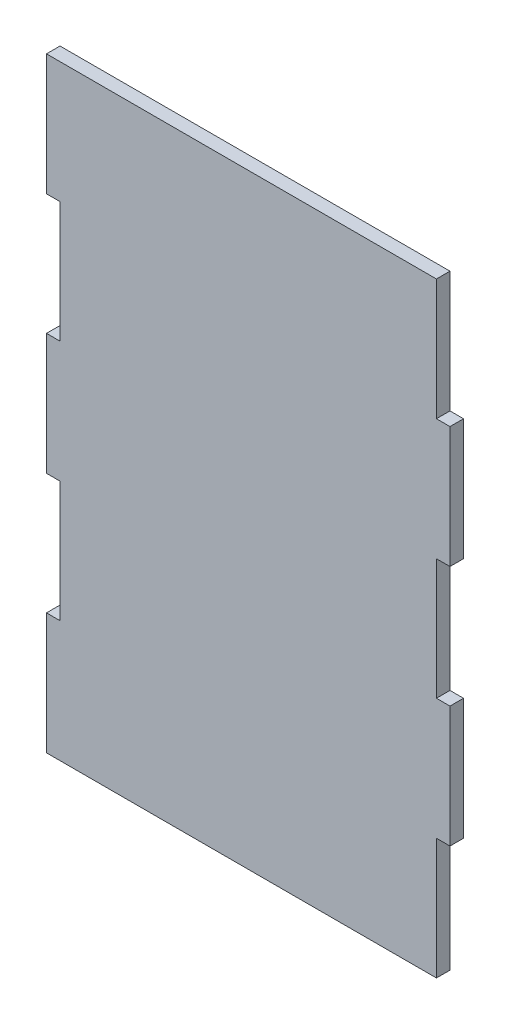
ISO-10303-21;
HEADER;
FILE_DESCRIPTION(('STEP AP214'),'2;1');
FILE_NAME('part.step','',(''),(''),'','','');
FILE_SCHEMA(('AUTOMOTIVE_DESIGN { 1 0 10303 214 1 1 1 1 }'));
ENDSEC;
DATA;
#1=APPLICATION_CONTEXT('core data for automotive mechanical design processes');
#2=APPLICATION_PROTOCOL_DEFINITION('international standard','automotive_design',2000,#1);
#3=PRODUCT_CONTEXT('',#1,'mechanical');
#4=PRODUCT('Part','Part','',(#3));
#5=PRODUCT_RELATED_PRODUCT_CATEGORY('part','',(#4));
#6=PRODUCT_DEFINITION_FORMATION('','',#4);
#7=PRODUCT_DEFINITION_CONTEXT('part definition',#1,'design');
#8=PRODUCT_DEFINITION('design','',#6,#7);
#9=PRODUCT_DEFINITION_SHAPE('','',#8);
#10=(LENGTH_UNIT() NAMED_UNIT(*) SI_UNIT(.MILLI.,.METRE.));
#11=(NAMED_UNIT(*) PLANE_ANGLE_UNIT() SI_UNIT($,.RADIAN.));
#12=(NAMED_UNIT(*) SI_UNIT($,.STERADIAN.) SOLID_ANGLE_UNIT());
#13=UNCERTAINTY_MEASURE_WITH_UNIT(LENGTH_MEASURE(1.E-05),#10,'distance_accuracy_value','');
#14=(GEOMETRIC_REPRESENTATION_CONTEXT(3) GLOBAL_UNCERTAINTY_ASSIGNED_CONTEXT((#13)) GLOBAL_UNIT_ASSIGNED_CONTEXT((#10,
#11,#12)) REPRESENTATION_CONTEXT('',''));
#15=CARTESIAN_POINT('',(0.,0.,0.));
#16=DIRECTION('',(0.,0.,1.));
#17=DIRECTION('',(1.,0.,0.));
#18=AXIS2_PLACEMENT_3D('',#15,#16,#17);
#19=CARTESIAN_POINT('',(-80.45314,-72.35686,-290.116912583318));
#20=DIRECTION('',(-1.,0.,0.));
#21=DIRECTION('',(0.,0.,1.));
#22=AXIS2_PLACEMENT_3D('',#19,#20,#21);
#23=PLANE('',#22);
#24=DIRECTION('',(0.,1.,0.));
#25=VECTOR('',#24,1.);
#26=CARTESIAN_POINT('',(-80.45314,-72.35686,0.));
#27=LINE('',#26,#25);
#28=CARTESIAN_POINT('',(-80.45314,-120.70314,0.));
#29=VERTEX_POINT('',#28);
#30=CARTESIAN_POINT('',(-80.45314,-72.35686,0.));
#31=VERTEX_POINT('',#30);
#32=EDGE_CURVE('E50',#29,#31,#27,.T.);
#33=ORIENTED_EDGE('',*,*,#32,.F.);
#34=DIRECTION('',(0.,0.,1.));
#35=VECTOR('',#34,1.);
#36=CARTESIAN_POINT('',(-80.45314,-120.70314,-290.116912583318));
#37=LINE('',#36,#35);
#38=CARTESIAN_POINT('',(-80.45314,-120.70314,5.4));
#39=VERTEX_POINT('',#38);
#40=EDGE_CURVE('E177',#29,#39,#37,.T.);
#41=ORIENTED_EDGE('',*,*,#40,.T.);
#42=DIRECTION('',(0.,-1.,0.));
#43=VECTOR('',#42,1.);
#44=CARTESIAN_POINT('',(-80.45314,-72.35686,5.4));
#45=LINE('',#44,#43);
#46=CARTESIAN_POINT('',(-80.45314,-72.35686,5.4));
#47=VERTEX_POINT('',#46);
#48=EDGE_CURVE('E181',#47,#39,#45,.T.);
#49=ORIENTED_EDGE('',*,*,#48,.F.);
#50=DIRECTION('',(0.,0.,1.));
#51=VECTOR('',#50,1.);
#52=CARTESIAN_POINT('',(-80.45314,-72.35686,-290.116912583318));
#53=LINE('',#52,#51);
#54=EDGE_CURVE('E273',#31,#47,#53,.T.);
#55=ORIENTED_EDGE('',*,*,#54,.F.);
#56=EDGE_LOOP('',(#33,#41,#49,#55));
#57=FACE_BOUND('',#56,.T.);
#58=ADVANCED_FACE('F41',(#57),#23,.T.);
#59=CARTESIAN_POINT('',(-75.05314,-72.35686,-290.116912583318));
#60=DIRECTION('',(0.,1.,0.));
#61=DIRECTION('',(0.,0.,1.));
#62=AXIS2_PLACEMENT_3D('',#59,#60,#61);
#63=PLANE('',#62);
#64=DIRECTION('',(1.,0.,0.));
#65=VECTOR('',#64,1.);
#66=CARTESIAN_POINT('',(-75.05314,-72.35686,0.));
#67=LINE('',#66,#65);
#68=CARTESIAN_POINT('',(-75.05314,-72.35686,0.));
#69=VERTEX_POINT('',#68);
#70=EDGE_CURVE('E377',#31,#69,#67,.T.);
#71=ORIENTED_EDGE('',*,*,#70,.F.);
#72=ORIENTED_EDGE('',*,*,#54,.T.);
#73=DIRECTION('',(-1.,0.,0.));
#74=VECTOR('',#73,1.);
#75=CARTESIAN_POINT('',(-75.05314,-72.35686,5.4));
#76=LINE('',#75,#74);
#77=CARTESIAN_POINT('',(-75.05314,-72.35686,5.4));
#78=VERTEX_POINT('',#77);
#79=EDGE_CURVE('E187',#78,#47,#76,.T.);
#80=ORIENTED_EDGE('',*,*,#79,.F.);
#81=DIRECTION('',(0.,0.,1.));
#82=VECTOR('',#81,1.);
#83=CARTESIAN_POINT('',(-75.05314,-72.35686,-290.116912583318));
#84=LINE('',#83,#82);
#85=EDGE_CURVE('E277',#69,#78,#84,.T.);
#86=ORIENTED_EDGE('',*,*,#85,.F.);
#87=EDGE_LOOP('',(#71,#72,#80,#86));
#88=FACE_BOUND('',#87,.T.);
#89=ADVANCED_FACE('F384',(#88),#63,.T.);
#90=CARTESIAN_POINT('',(-75.05314,-24.17314,-290.116912583318));
#91=DIRECTION('',(-1.,0.,0.));
#92=DIRECTION('',(0.,0.,1.));
#93=AXIS2_PLACEMENT_3D('',#90,#91,#92);
#94=PLANE('',#93);
#95=DIRECTION('',(0.,1.,0.));
#96=VECTOR('',#95,1.);
#97=CARTESIAN_POINT('',(-75.05314,-24.17314,0.));
#98=LINE('',#97,#96);
#99=CARTESIAN_POINT('',(-75.05314,-24.17314,0.));
#100=VERTEX_POINT('',#99);
#101=EDGE_CURVE('E374',#69,#100,#98,.T.);
#102=ORIENTED_EDGE('',*,*,#101,.F.);
#103=ORIENTED_EDGE('',*,*,#85,.T.);
#104=DIRECTION('',(0.,-1.,0.));
#105=VECTOR('',#104,1.);
#106=CARTESIAN_POINT('',(-75.05314,-24.17314,5.4));
#107=LINE('',#106,#105);
#108=CARTESIAN_POINT('',(-75.05314,-24.17314,5.4));
#109=VERTEX_POINT('',#108);
#110=EDGE_CURVE('E268',#109,#78,#107,.T.);
#111=ORIENTED_EDGE('',*,*,#110,.F.);
#112=DIRECTION('',(0.,0.,1.));
#113=VECTOR('',#112,1.);
#114=CARTESIAN_POINT('',(-75.05314,-24.17314,-290.116912583318));
#115=LINE('',#114,#113);
#116=EDGE_CURVE('E280',#100,#109,#115,.T.);
#117=ORIENTED_EDGE('',*,*,#116,.F.);
#118=EDGE_LOOP('',(#102,#103,#111,#117));
#119=FACE_BOUND('',#118,.T.);
#120=ADVANCED_FACE('F387',(#119),#94,.T.);
#121=CARTESIAN_POINT('',(-80.45314,-24.17314,-290.116912583318));
#122=DIRECTION('',(0.,-1.,0.));
#123=DIRECTION('',(1.,0.,0.));
#124=AXIS2_PLACEMENT_3D('',#121,#122,#123);
#125=PLANE('',#124);
#126=DIRECTION('',(-1.,0.,0.));
#127=VECTOR('',#126,1.);
#128=CARTESIAN_POINT('',(-80.45314,-24.17314,0.));
#129=LINE('',#128,#127);
#130=CARTESIAN_POINT('',(-80.45314,-24.17314,0.));
#131=VERTEX_POINT('',#130);
#132=EDGE_CURVE('E371',#100,#131,#129,.T.);
#133=ORIENTED_EDGE('',*,*,#132,.F.);
#134=ORIENTED_EDGE('',*,*,#116,.T.);
#135=DIRECTION('',(1.,0.,0.));
#136=VECTOR('',#135,1.);
#137=CARTESIAN_POINT('',(-80.45314,-24.17314,5.4));
#138=LINE('',#137,#136);
#139=CARTESIAN_POINT('',(-80.45314,-24.17314,5.4));
#140=VERTEX_POINT('',#139);
#141=EDGE_CURVE('E264',#140,#109,#138,.T.);
#142=ORIENTED_EDGE('',*,*,#141,.F.);
#143=DIRECTION('',(0.,0.,1.));
#144=VECTOR('',#143,1.);
#145=CARTESIAN_POINT('',(-80.45314,-24.17314,-290.116912583318));
#146=LINE('',#145,#144);
#147=EDGE_CURVE('E283',#131,#140,#146,.T.);
#148=ORIENTED_EDGE('',*,*,#147,.F.);
#149=EDGE_LOOP('',(#133,#134,#142,#148));
#150=FACE_BOUND('',#149,.T.);
#151=ADVANCED_FACE('F394',(#150),#125,.T.);
#152=CARTESIAN_POINT('',(-80.45314,24.17314,-290.116912583318));
#153=DIRECTION('',(-1.,0.,0.));
#154=DIRECTION('',(0.,0.,1.));
#155=AXIS2_PLACEMENT_3D('',#152,#153,#154);
#156=PLANE('',#155);
#157=DIRECTION('',(0.,1.,0.));
#158=VECTOR('',#157,1.);
#159=CARTESIAN_POINT('',(-80.45314,24.17314,0.));
#160=LINE('',#159,#158);
#161=CARTESIAN_POINT('',(-80.45314,24.17314,0.));
#162=VERTEX_POINT('',#161);
#163=EDGE_CURVE('E368',#131,#162,#160,.T.);
#164=ORIENTED_EDGE('',*,*,#163,.F.);
#165=ORIENTED_EDGE('',*,*,#147,.T.);
#166=DIRECTION('',(0.,-1.,0.));
#167=VECTOR('',#166,1.);
#168=CARTESIAN_POINT('',(-80.45314,24.17314,5.4));
#169=LINE('',#168,#167);
#170=CARTESIAN_POINT('',(-80.45314,24.17314,5.4));
#171=VERTEX_POINT('',#170);
#172=EDGE_CURVE('E260',#171,#140,#169,.T.);
#173=ORIENTED_EDGE('',*,*,#172,.F.);
#174=DIRECTION('',(0.,0.,1.));
#175=VECTOR('',#174,1.);
#176=CARTESIAN_POINT('',(-80.45314,24.17314,-290.116912583318));
#177=LINE('',#176,#175);
#178=EDGE_CURVE('E286',#162,#171,#177,.T.);
#179=ORIENTED_EDGE('',*,*,#178,.F.);
#180=EDGE_LOOP('',(#164,#165,#173,#179));
#181=FACE_BOUND('',#180,.T.);
#182=ADVANCED_FACE('F399',(#181),#156,.T.);
#183=CARTESIAN_POINT('',(-75.05314,24.17314,-290.116912583318));
#184=DIRECTION('',(0.,1.,0.));
#185=DIRECTION('',(-1.,0.,0.));
#186=AXIS2_PLACEMENT_3D('',#183,#184,#185);
#187=PLANE('',#186);
#188=DIRECTION('',(1.,0.,0.));
#189=VECTOR('',#188,1.);
#190=CARTESIAN_POINT('',(-75.05314,24.17314,0.));
#191=LINE('',#190,#189);
#192=CARTESIAN_POINT('',(-75.05314,24.17314,0.));
#193=VERTEX_POINT('',#192);
#194=EDGE_CURVE('E365',#162,#193,#191,.T.);
#195=ORIENTED_EDGE('',*,*,#194,.F.);
#196=ORIENTED_EDGE('',*,*,#178,.T.);
#197=DIRECTION('',(-1.,0.,0.));
#198=VECTOR('',#197,1.);
#199=CARTESIAN_POINT('',(-75.05314,24.17314,5.4));
#200=LINE('',#199,#198);
#201=CARTESIAN_POINT('',(-75.05314,24.17314,5.4));
#202=VERTEX_POINT('',#201);
#203=EDGE_CURVE('E256',#202,#171,#200,.T.);
#204=ORIENTED_EDGE('',*,*,#203,.F.);
#205=DIRECTION('',(0.,0.,1.));
#206=VECTOR('',#205,1.);
#207=CARTESIAN_POINT('',(-75.05314,24.17314,-290.116912583318));
#208=LINE('',#207,#206);
#209=EDGE_CURVE('E289',#193,#202,#208,.T.);
#210=ORIENTED_EDGE('',*,*,#209,.F.);
#211=EDGE_LOOP('',(#195,#196,#204,#210));
#212=FACE_BOUND('',#211,.T.);
#213=ADVANCED_FACE('F402',(#212),#187,.T.);
#214=CARTESIAN_POINT('',(-75.05314,72.35686,-290.116912583318));
#215=DIRECTION('',(-1.,0.,0.));
#216=DIRECTION('',(0.,0.,1.));
#217=AXIS2_PLACEMENT_3D('',#214,#215,#216);
#218=PLANE('',#217);
#219=DIRECTION('',(0.,1.,0.));
#220=VECTOR('',#219,1.);
#221=CARTESIAN_POINT('',(-75.05314,72.35686,0.));
#222=LINE('',#221,#220);
#223=CARTESIAN_POINT('',(-75.05314,72.35686,0.));
#224=VERTEX_POINT('',#223);
#225=EDGE_CURVE('E362',#193,#224,#222,.T.);
#226=ORIENTED_EDGE('',*,*,#225,.F.);
#227=ORIENTED_EDGE('',*,*,#209,.T.);
#228=DIRECTION('',(0.,-1.,0.));
#229=VECTOR('',#228,1.);
#230=CARTESIAN_POINT('',(-75.05314,72.35686,5.4));
#231=LINE('',#230,#229);
#232=CARTESIAN_POINT('',(-75.05314,72.35686,5.4));
#233=VERTEX_POINT('',#232);
#234=EDGE_CURVE('E252',#233,#202,#231,.T.);
#235=ORIENTED_EDGE('',*,*,#234,.F.);
#236=DIRECTION('',(0.,0.,1.));
#237=VECTOR('',#236,1.);
#238=CARTESIAN_POINT('',(-75.05314,72.35686,-290.116912583318));
#239=LINE('',#238,#237);
#240=EDGE_CURVE('E292',#224,#233,#239,.T.);
#241=ORIENTED_EDGE('',*,*,#240,.F.);
#242=EDGE_LOOP('',(#226,#227,#235,#241));
#243=FACE_BOUND('',#242,.T.);
#244=ADVANCED_FACE('F408',(#243),#218,.T.);
#245=CARTESIAN_POINT('',(-80.45314,72.35686,-290.116912583318));
#246=DIRECTION('',(0.,-1.,0.));
#247=DIRECTION('',(0.,0.,-1.));
#248=AXIS2_PLACEMENT_3D('',#245,#246,#247);
#249=PLANE('',#248);
#250=DIRECTION('',(-1.,0.,0.));
#251=VECTOR('',#250,1.);
#252=CARTESIAN_POINT('',(-80.45314,72.35686,0.));
#253=LINE('',#252,#251);
#254=CARTESIAN_POINT('',(-80.45314,72.35686,0.));
#255=VERTEX_POINT('',#254);
#256=EDGE_CURVE('E359',#224,#255,#253,.T.);
#257=ORIENTED_EDGE('',*,*,#256,.F.);
#258=ORIENTED_EDGE('',*,*,#240,.T.);
#259=DIRECTION('',(1.,0.,0.));
#260=VECTOR('',#259,1.);
#261=CARTESIAN_POINT('',(-80.45314,72.35686,5.4));
#262=LINE('',#261,#260);
#263=CARTESIAN_POINT('',(-80.45314,72.35686,5.4));
#264=VERTEX_POINT('',#263);
#265=EDGE_CURVE('E248',#264,#233,#262,.T.);
#266=ORIENTED_EDGE('',*,*,#265,.F.);
#267=DIRECTION('',(0.,0.,1.));
#268=VECTOR('',#267,1.);
#269=CARTESIAN_POINT('',(-80.45314,72.35686,-290.116912583318));
#270=LINE('',#269,#268);
#271=EDGE_CURVE('E295',#255,#264,#270,.T.);
#272=ORIENTED_EDGE('',*,*,#271,.F.);
#273=EDGE_LOOP('',(#257,#258,#266,#272));
#274=FACE_BOUND('',#273,.T.);
#275=ADVANCED_FACE('F412',(#274),#249,.T.);
#276=CARTESIAN_POINT('',(-80.45314,120.70314,-290.116912583318));
#277=DIRECTION('',(-1.,0.,0.));
#278=DIRECTION('',(0.,0.,1.));
#279=AXIS2_PLACEMENT_3D('',#276,#277,#278);
#280=PLANE('',#279);
#281=DIRECTION('',(0.,1.,0.));
#282=VECTOR('',#281,1.);
#283=CARTESIAN_POINT('',(-80.45314,120.70314,0.));
#284=LINE('',#283,#282);
#285=CARTESIAN_POINT('',(-80.45314,120.70314,0.));
#286=VERTEX_POINT('',#285);
#287=EDGE_CURVE('E356',#255,#286,#284,.T.);
#288=ORIENTED_EDGE('',*,*,#287,.F.);
#289=ORIENTED_EDGE('',*,*,#271,.T.);
#290=DIRECTION('',(0.,-1.,0.));
#291=VECTOR('',#290,1.);
#292=CARTESIAN_POINT('',(-80.45314,120.70314,5.4));
#293=LINE('',#292,#291);
#294=CARTESIAN_POINT('',(-80.45314,120.70314,5.4));
#295=VERTEX_POINT('',#294);
#296=EDGE_CURVE('E244',#295,#264,#293,.T.);
#297=ORIENTED_EDGE('',*,*,#296,.F.);
#298=DIRECTION('',(0.,0.,1.));
#299=VECTOR('',#298,1.);
#300=CARTESIAN_POINT('',(-80.45314,120.70314,-290.116912583318));
#301=LINE('',#300,#299);
#302=EDGE_CURVE('E298',#286,#295,#301,.T.);
#303=ORIENTED_EDGE('',*,*,#302,.F.);
#304=EDGE_LOOP('',(#288,#289,#297,#303));
#305=FACE_BOUND('',#304,.T.);
#306=ADVANCED_FACE('F418',(#305),#280,.T.);
#307=CARTESIAN_POINT('',(75.05314,120.70314,-290.116912583318));
#308=DIRECTION('',(0.,1.,0.));
#309=DIRECTION('',(-1.,0.,0.));
#310=AXIS2_PLACEMENT_3D('',#307,#308,#309);
#311=PLANE('',#310);
#312=DIRECTION('',(1.,0.,0.));
#313=VECTOR('',#312,1.);
#314=CARTESIAN_POINT('',(75.05314,120.70314,0.));
#315=LINE('',#314,#313);
#316=CARTESIAN_POINT('',(75.05314,120.70314,0.));
#317=VERTEX_POINT('',#316);
#318=EDGE_CURVE('E353',#286,#317,#315,.T.);
#319=ORIENTED_EDGE('',*,*,#318,.F.);
#320=ORIENTED_EDGE('',*,*,#302,.T.);
#321=DIRECTION('',(-1.,0.,0.));
#322=VECTOR('',#321,1.);
#323=CARTESIAN_POINT('',(75.05314,120.70314,5.4));
#324=LINE('',#323,#322);
#325=CARTESIAN_POINT('',(75.05314,120.70314,5.4));
#326=VERTEX_POINT('',#325);
#327=EDGE_CURVE('E240',#326,#295,#324,.T.);
#328=ORIENTED_EDGE('',*,*,#327,.F.);
#329=DIRECTION('',(0.,0.,1.));
#330=VECTOR('',#329,1.);
#331=CARTESIAN_POINT('',(75.05314,120.70314,-290.116912583318));
#332=LINE('',#331,#330);
#333=EDGE_CURVE('E301',#317,#326,#332,.T.);
#334=ORIENTED_EDGE('',*,*,#333,.F.);
#335=EDGE_LOOP('',(#319,#320,#328,#334));
#336=FACE_BOUND('',#335,.T.);
#337=ADVANCED_FACE('F422',(#336),#311,.T.);
#338=CARTESIAN_POINT('',(75.05314,72.43814,-290.116912583318));
#339=DIRECTION('',(1.,0.,0.));
#340=DIRECTION('',(0.,0.,-1.));
#341=AXIS2_PLACEMENT_3D('',#338,#339,#340);
#342=PLANE('',#341);
#343=DIRECTION('',(0.,-1.,0.));
#344=VECTOR('',#343,1.);
#345=CARTESIAN_POINT('',(75.05314,72.43814,0.));
#346=LINE('',#345,#344);
#347=CARTESIAN_POINT('',(75.05314,72.43814,0.));
#348=VERTEX_POINT('',#347);
#349=EDGE_CURVE('E350',#317,#348,#346,.T.);
#350=ORIENTED_EDGE('',*,*,#349,.F.);
#351=ORIENTED_EDGE('',*,*,#333,.T.);
#352=DIRECTION('',(0.,1.,0.));
#353=VECTOR('',#352,1.);
#354=CARTESIAN_POINT('',(75.05314,72.43814,5.4));
#355=LINE('',#354,#353);
#356=CARTESIAN_POINT('',(75.05314,72.43814,5.4));
#357=VERTEX_POINT('',#356);
#358=EDGE_CURVE('E236',#357,#326,#355,.T.);
#359=ORIENTED_EDGE('',*,*,#358,.F.);
#360=DIRECTION('',(0.,0.,1.));
#361=VECTOR('',#360,1.);
#362=CARTESIAN_POINT('',(75.05314,72.43814,-290.116912583318));
#363=LINE('',#362,#361);
#364=EDGE_CURVE('E304',#348,#357,#363,.T.);
#365=ORIENTED_EDGE('',*,*,#364,.F.);
#366=EDGE_LOOP('',(#350,#351,#359,#365));
#367=FACE_BOUND('',#366,.T.);
#368=ADVANCED_FACE('F428',(#367),#342,.T.);
#369=CARTESIAN_POINT('',(80.45314,72.43814,-290.116912583318));
#370=DIRECTION('',(0.,1.,0.));
#371=DIRECTION('',(0.,0.,1.));
#372=AXIS2_PLACEMENT_3D('',#369,#370,#371);
#373=PLANE('',#372);
#374=DIRECTION('',(1.,0.,0.));
#375=VECTOR('',#374,1.);
#376=CARTESIAN_POINT('',(80.45314,72.43814,0.));
#377=LINE('',#376,#375);
#378=CARTESIAN_POINT('',(80.45314,72.43814,0.));
#379=VERTEX_POINT('',#378);
#380=EDGE_CURVE('E347',#348,#379,#377,.T.);
#381=ORIENTED_EDGE('',*,*,#380,.F.);
#382=ORIENTED_EDGE('',*,*,#364,.T.);
#383=DIRECTION('',(-1.,0.,0.));
#384=VECTOR('',#383,1.);
#385=CARTESIAN_POINT('',(80.45314,72.43814,5.4));
#386=LINE('',#385,#384);
#387=CARTESIAN_POINT('',(80.45314,72.43814,5.4));
#388=VERTEX_POINT('',#387);
#389=EDGE_CURVE('E232',#388,#357,#386,.T.);
#390=ORIENTED_EDGE('',*,*,#389,.F.);
#391=DIRECTION('',(0.,0.,1.));
#392=VECTOR('',#391,1.);
#393=CARTESIAN_POINT('',(80.45314,72.43814,-290.116912583318));
#394=LINE('',#393,#392);
#395=EDGE_CURVE('E307',#379,#388,#394,.T.);
#396=ORIENTED_EDGE('',*,*,#395,.F.);
#397=EDGE_LOOP('',(#381,#382,#390,#396));
#398=FACE_BOUND('',#397,.T.);
#399=ADVANCED_FACE('F432',(#398),#373,.T.);
#400=CARTESIAN_POINT('',(80.45314,24.09186,-290.116912583318));
#401=DIRECTION('',(1.,0.,0.));
#402=DIRECTION('',(0.,0.,-1.));
#403=AXIS2_PLACEMENT_3D('',#400,#401,#402);
#404=PLANE('',#403);
#405=DIRECTION('',(0.,-1.,0.));
#406=VECTOR('',#405,1.);
#407=CARTESIAN_POINT('',(80.45314,24.09186,0.));
#408=LINE('',#407,#406);
#409=CARTESIAN_POINT('',(80.45314,24.09186,0.));
#410=VERTEX_POINT('',#409);
#411=EDGE_CURVE('E344',#379,#410,#408,.T.);
#412=ORIENTED_EDGE('',*,*,#411,.F.);
#413=ORIENTED_EDGE('',*,*,#395,.T.);
#414=DIRECTION('',(0.,1.,0.));
#415=VECTOR('',#414,1.);
#416=CARTESIAN_POINT('',(80.45314,24.09186,5.4));
#417=LINE('',#416,#415);
#418=CARTESIAN_POINT('',(80.45314,24.09186,5.4));
#419=VERTEX_POINT('',#418);
#420=EDGE_CURVE('E228',#419,#388,#417,.T.);
#421=ORIENTED_EDGE('',*,*,#420,.F.);
#422=DIRECTION('',(0.,0.,1.));
#423=VECTOR('',#422,1.);
#424=CARTESIAN_POINT('',(80.45314,24.09186,-290.116912583318));
#425=LINE('',#424,#423);
#426=EDGE_CURVE('E310',#410,#419,#425,.T.);
#427=ORIENTED_EDGE('',*,*,#426,.F.);
#428=EDGE_LOOP('',(#412,#413,#421,#427));
#429=FACE_BOUND('',#428,.T.);
#430=ADVANCED_FACE('F438',(#429),#404,.T.);
#431=CARTESIAN_POINT('',(75.05314,24.09186,-290.116912583318));
#432=DIRECTION('',(0.,-1.,0.));
#433=DIRECTION('',(0.,0.,-1.));
#434=AXIS2_PLACEMENT_3D('',#431,#432,#433);
#435=PLANE('',#434);
#436=DIRECTION('',(-1.,0.,0.));
#437=VECTOR('',#436,1.);
#438=CARTESIAN_POINT('',(75.05314,24.09186,0.));
#439=LINE('',#438,#437);
#440=CARTESIAN_POINT('',(75.05314,24.09186,0.));
#441=VERTEX_POINT('',#440);
#442=EDGE_CURVE('E341',#410,#441,#439,.T.);
#443=ORIENTED_EDGE('',*,*,#442,.F.);
#444=ORIENTED_EDGE('',*,*,#426,.T.);
#445=DIRECTION('',(1.,0.,0.));
#446=VECTOR('',#445,1.);
#447=CARTESIAN_POINT('',(75.05314,24.09186,5.4));
#448=LINE('',#447,#446);
#449=CARTESIAN_POINT('',(75.05314,24.09186,5.4));
#450=VERTEX_POINT('',#449);
#451=EDGE_CURVE('E224',#450,#419,#448,.T.);
#452=ORIENTED_EDGE('',*,*,#451,.F.);
#453=DIRECTION('',(0.,0.,1.));
#454=VECTOR('',#453,1.);
#455=CARTESIAN_POINT('',(75.05314,24.09186,-290.116912583318));
#456=LINE('',#455,#454);
#457=EDGE_CURVE('E313',#441,#450,#456,.T.);
#458=ORIENTED_EDGE('',*,*,#457,.F.);
#459=EDGE_LOOP('',(#443,#444,#452,#458));
#460=FACE_BOUND('',#459,.T.);
#461=ADVANCED_FACE('F442',(#460),#435,.T.);
#462=CARTESIAN_POINT('',(75.05314,-24.09186,-290.116912583318));
#463=DIRECTION('',(1.,0.,0.));
#464=DIRECTION('',(0.,0.,-1.));
#465=AXIS2_PLACEMENT_3D('',#462,#463,#464);
#466=PLANE('',#465);
#467=DIRECTION('',(0.,-1.,0.));
#468=VECTOR('',#467,1.);
#469=CARTESIAN_POINT('',(75.05314,-24.09186,0.));
#470=LINE('',#469,#468);
#471=CARTESIAN_POINT('',(75.05314,-24.09186,0.));
#472=VERTEX_POINT('',#471);
#473=EDGE_CURVE('E338',#441,#472,#470,.T.);
#474=ORIENTED_EDGE('',*,*,#473,.F.);
#475=ORIENTED_EDGE('',*,*,#457,.T.);
#476=DIRECTION('',(0.,1.,0.));
#477=VECTOR('',#476,1.);
#478=CARTESIAN_POINT('',(75.05314,-24.09186,5.4));
#479=LINE('',#478,#477);
#480=CARTESIAN_POINT('',(75.05314,-24.09186,5.4));
#481=VERTEX_POINT('',#480);
#482=EDGE_CURVE('E220',#481,#450,#479,.T.);
#483=ORIENTED_EDGE('',*,*,#482,.F.);
#484=DIRECTION('',(0.,0.,1.));
#485=VECTOR('',#484,1.);
#486=CARTESIAN_POINT('',(75.05314,-24.09186,-290.116912583318));
#487=LINE('',#486,#485);
#488=EDGE_CURVE('E316',#472,#481,#487,.T.);
#489=ORIENTED_EDGE('',*,*,#488,.F.);
#490=EDGE_LOOP('',(#474,#475,#483,#489));
#491=FACE_BOUND('',#490,.T.);
#492=ADVANCED_FACE('F448',(#491),#466,.T.);
#493=CARTESIAN_POINT('',(80.45314,-24.09186,-290.116912583318));
#494=DIRECTION('',(0.,1.,0.));
#495=DIRECTION('',(0.,0.,1.));
#496=AXIS2_PLACEMENT_3D('',#493,#494,#495);
#497=PLANE('',#496);
#498=DIRECTION('',(1.,0.,0.));
#499=VECTOR('',#498,1.);
#500=CARTESIAN_POINT('',(80.45314,-24.09186,0.));
#501=LINE('',#500,#499);
#502=CARTESIAN_POINT('',(80.45314,-24.09186,0.));
#503=VERTEX_POINT('',#502);
#504=EDGE_CURVE('E335',#472,#503,#501,.T.);
#505=ORIENTED_EDGE('',*,*,#504,.F.);
#506=ORIENTED_EDGE('',*,*,#488,.T.);
#507=DIRECTION('',(-1.,0.,0.));
#508=VECTOR('',#507,1.);
#509=CARTESIAN_POINT('',(80.45314,-24.09186,5.4));
#510=LINE('',#509,#508);
#511=CARTESIAN_POINT('',(80.45314,-24.09186,5.4));
#512=VERTEX_POINT('',#511);
#513=EDGE_CURVE('E216',#512,#481,#510,.T.);
#514=ORIENTED_EDGE('',*,*,#513,.F.);
#515=DIRECTION('',(0.,0.,1.));
#516=VECTOR('',#515,1.);
#517=CARTESIAN_POINT('',(80.45314,-24.09186,-290.116912583318));
#518=LINE('',#517,#516);
#519=EDGE_CURVE('E319',#503,#512,#518,.T.);
#520=ORIENTED_EDGE('',*,*,#519,.F.);
#521=EDGE_LOOP('',(#505,#506,#514,#520));
#522=FACE_BOUND('',#521,.T.);
#523=ADVANCED_FACE('F452',(#522),#497,.T.);
#524=CARTESIAN_POINT('',(80.45314,-72.43814,-290.116912583318));
#525=DIRECTION('',(1.,0.,0.));
#526=DIRECTION('',(0.,0.,-1.));
#527=AXIS2_PLACEMENT_3D('',#524,#525,#526);
#528=PLANE('',#527);
#529=DIRECTION('',(0.,-1.,0.));
#530=VECTOR('',#529,1.);
#531=CARTESIAN_POINT('',(80.45314,-72.43814,0.));
#532=LINE('',#531,#530);
#533=CARTESIAN_POINT('',(80.45314,-72.43814,0.));
#534=VERTEX_POINT('',#533);
#535=EDGE_CURVE('E62',#503,#534,#532,.T.);
#536=ORIENTED_EDGE('',*,*,#535,.F.);
#537=ORIENTED_EDGE('',*,*,#519,.T.);
#538=DIRECTION('',(0.,1.,0.));
#539=VECTOR('',#538,1.);
#540=CARTESIAN_POINT('',(80.45314,-72.43814,5.4));
#541=LINE('',#540,#539);
#542=CARTESIAN_POINT('',(80.45314,-72.43814,5.4));
#543=VERTEX_POINT('',#542);
#544=EDGE_CURVE('E212',#543,#512,#541,.T.);
#545=ORIENTED_EDGE('',*,*,#544,.F.);
#546=DIRECTION('',(0.,0.,1.));
#547=VECTOR('',#546,1.);
#548=CARTESIAN_POINT('',(80.45314,-72.43814,-290.116912583318));
#549=LINE('',#548,#547);
#550=EDGE_CURVE('E322',#534,#543,#549,.T.);
#551=ORIENTED_EDGE('',*,*,#550,.F.);
#552=EDGE_LOOP('',(#536,#537,#545,#551));
#553=FACE_BOUND('',#552,.T.);
#554=ADVANCED_FACE('F456',(#553),#528,.T.);
#555=CARTESIAN_POINT('',(75.05314,-72.43814,-290.116912583318));
#556=DIRECTION('',(0.,-1.,0.));
#557=DIRECTION('',(0.,0.,-1.));
#558=AXIS2_PLACEMENT_3D('',#555,#556,#557);
#559=PLANE('',#558);
#560=DIRECTION('',(-1.,0.,0.));
#561=VECTOR('',#560,1.);
#562=CARTESIAN_POINT('',(75.05314,-72.43814,0.));
#563=LINE('',#562,#561);
#564=CARTESIAN_POINT('',(75.05314,-72.43814,0.));
#565=VERTEX_POINT('',#564);
#566=EDGE_CURVE('E57',#534,#565,#563,.T.);
#567=ORIENTED_EDGE('',*,*,#566,.F.);
#568=ORIENTED_EDGE('',*,*,#550,.T.);
#569=DIRECTION('',(1.,0.,0.));
#570=VECTOR('',#569,1.);
#571=CARTESIAN_POINT('',(75.05314,-72.43814,5.4));
#572=LINE('',#571,#570);
#573=CARTESIAN_POINT('',(75.05314,-72.43814,5.4));
#574=VERTEX_POINT('',#573);
#575=EDGE_CURVE('E208',#574,#543,#572,.T.);
#576=ORIENTED_EDGE('',*,*,#575,.F.);
#577=DIRECTION('',(0.,0.,1.));
#578=VECTOR('',#577,1.);
#579=CARTESIAN_POINT('',(75.05314,-72.43814,-290.116912583318));
#580=LINE('',#579,#578);
#581=EDGE_CURVE('E325',#565,#574,#580,.T.);
#582=ORIENTED_EDGE('',*,*,#581,.F.);
#583=EDGE_LOOP('',(#567,#568,#576,#582));
#584=FACE_BOUND('',#583,.T.);
#585=ADVANCED_FACE('F460',(#584),#559,.T.);
#586=CARTESIAN_POINT('',(75.05314,-120.70314,-290.116912583318));
#587=DIRECTION('',(1.,0.,0.));
#588=DIRECTION('',(0.,0.,-1.));
#589=AXIS2_PLACEMENT_3D('',#586,#587,#588);
#590=PLANE('',#589);
#591=DIRECTION('',(0.,-1.,0.));
#592=VECTOR('',#591,1.);
#593=CARTESIAN_POINT('',(75.05314,-120.70314,0.));
#594=LINE('',#593,#592);
#595=CARTESIAN_POINT('',(75.05314,-120.70314,0.));
#596=VERTEX_POINT('',#595);
#597=EDGE_CURVE('E276',#565,#596,#594,.T.);
#598=ORIENTED_EDGE('',*,*,#597,.F.);
#599=ORIENTED_EDGE('',*,*,#581,.T.);
#600=DIRECTION('',(0.,1.,0.));
#601=VECTOR('',#600,1.);
#602=CARTESIAN_POINT('',(75.05314,-120.70314,5.4));
#603=LINE('',#602,#601);
#604=CARTESIAN_POINT('',(75.05314,-120.70314,5.4));
#605=VERTEX_POINT('',#604);
#606=EDGE_CURVE('E196',#605,#574,#603,.T.);
#607=ORIENTED_EDGE('',*,*,#606,.F.);
#608=DIRECTION('',(0.,0.,1.));
#609=VECTOR('',#608,1.);
#610=CARTESIAN_POINT('',(75.05314,-120.70314,-290.116912583318));
#611=LINE('',#610,#609);
#612=EDGE_CURVE('E186',#596,#605,#611,.T.);
#613=ORIENTED_EDGE('',*,*,#612,.F.);
#614=EDGE_LOOP('',(#598,#599,#607,#613));
#615=FACE_BOUND('',#614,.T.);
#616=ADVANCED_FACE('F463',(#615),#590,.T.);
#617=CARTESIAN_POINT('',(-80.45314,-120.70314,-290.116912583318));
#618=DIRECTION('',(0.,-1.,0.));
#619=DIRECTION('',(0.,0.,-1.));
#620=AXIS2_PLACEMENT_3D('',#617,#618,#619);
#621=PLANE('',#620);
#622=DIRECTION('',(-1.,0.,0.));
#623=VECTOR('',#622,1.);
#624=CARTESIAN_POINT('',(-80.45314,-120.70314,0.));
#625=LINE('',#624,#623);
#626=EDGE_CURVE('E11',#596,#29,#625,.T.);
#627=ORIENTED_EDGE('',*,*,#626,.F.);
#628=ORIENTED_EDGE('',*,*,#612,.T.);
#629=DIRECTION('',(1.,0.,0.));
#630=VECTOR('',#629,1.);
#631=CARTESIAN_POINT('',(-80.45314,-120.70314,5.4));
#632=LINE('',#631,#630);
#633=EDGE_CURVE('E189',#39,#605,#632,.T.);
#634=ORIENTED_EDGE('',*,*,#633,.F.);
#635=ORIENTED_EDGE('',*,*,#40,.F.);
#636=EDGE_LOOP('',(#627,#628,#634,#635));
#637=FACE_BOUND('',#636,.T.);
#638=ADVANCED_FACE('F190',(#637),#621,.T.);
#639=CARTESIAN_POINT('',(0.,0.,0.));
#640=DIRECTION('',(0.,0.,1.));
#641=DIRECTION('',(1.,0.,0.));
#642=AXIS2_PLACEMENT_3D('',#639,#640,#641);
#643=PLANE('',#642);
#644=ORIENTED_EDGE('',*,*,#32,.T.);
#645=ORIENTED_EDGE('',*,*,#70,.T.);
#646=ORIENTED_EDGE('',*,*,#101,.T.);
#647=ORIENTED_EDGE('',*,*,#132,.T.);
#648=ORIENTED_EDGE('',*,*,#163,.T.);
#649=ORIENTED_EDGE('',*,*,#194,.T.);
#650=ORIENTED_EDGE('',*,*,#225,.T.);
#651=ORIENTED_EDGE('',*,*,#256,.T.);
#652=ORIENTED_EDGE('',*,*,#287,.T.);
#653=ORIENTED_EDGE('',*,*,#318,.T.);
#654=ORIENTED_EDGE('',*,*,#349,.T.);
#655=ORIENTED_EDGE('',*,*,#380,.T.);
#656=ORIENTED_EDGE('',*,*,#411,.T.);
#657=ORIENTED_EDGE('',*,*,#442,.T.);
#658=ORIENTED_EDGE('',*,*,#473,.T.);
#659=ORIENTED_EDGE('',*,*,#504,.T.);
#660=ORIENTED_EDGE('',*,*,#535,.T.);
#661=ORIENTED_EDGE('',*,*,#566,.T.);
#662=ORIENTED_EDGE('',*,*,#597,.T.);
#663=ORIENTED_EDGE('',*,*,#626,.T.);
#664=EDGE_LOOP('',(#644,#645,#646,#647,#648,#649,#650,#651,#652,#653,#654,#655,#656,#657,#658,
#659,#660,#661,#662,#663));
#665=FACE_BOUND('',#664,.T.);
#666=ADVANCED_FACE('F43',(#665),#643,.F.);
#667=CARTESIAN_POINT('',(0.,0.,5.4));
#668=DIRECTION('',(0.,0.,1.));
#669=DIRECTION('',(1.,0.,0.));
#670=AXIS2_PLACEMENT_3D('',#667,#668,#669);
#671=PLANE('',#670);
#672=ORIENTED_EDGE('',*,*,#48,.T.);
#673=ORIENTED_EDGE('',*,*,#633,.T.);
#674=ORIENTED_EDGE('',*,*,#606,.T.);
#675=ORIENTED_EDGE('',*,*,#575,.T.);
#676=ORIENTED_EDGE('',*,*,#544,.T.);
#677=ORIENTED_EDGE('',*,*,#513,.T.);
#678=ORIENTED_EDGE('',*,*,#482,.T.);
#679=ORIENTED_EDGE('',*,*,#451,.T.);
#680=ORIENTED_EDGE('',*,*,#420,.T.);
#681=ORIENTED_EDGE('',*,*,#389,.T.);
#682=ORIENTED_EDGE('',*,*,#358,.T.);
#683=ORIENTED_EDGE('',*,*,#327,.T.);
#684=ORIENTED_EDGE('',*,*,#296,.T.);
#685=ORIENTED_EDGE('',*,*,#265,.T.);
#686=ORIENTED_EDGE('',*,*,#234,.T.);
#687=ORIENTED_EDGE('',*,*,#203,.T.);
#688=ORIENTED_EDGE('',*,*,#172,.T.);
#689=ORIENTED_EDGE('',*,*,#141,.T.);
#690=ORIENTED_EDGE('',*,*,#110,.T.);
#691=ORIENTED_EDGE('',*,*,#79,.T.);
#692=EDGE_LOOP('',(#672,#673,#674,#675,#676,#677,#678,#679,#680,#681,#682,#683,#684,#685,#686,
#687,#688,#689,#690,#691));
#693=FACE_BOUND('',#692,.T.);
#694=ADVANCED_FACE('F198',(#693),#671,.T.);
#695=CLOSED_SHELL('',(#58,#89,#120,#151,#182,#213,#244,#275,#306,#337,#368,#399,#430,#461,#492,
#523,#554,#585,#616,#638,#666,#694));
#696=MANIFOLD_SOLID_BREP('B2',#695);
#697=ADVANCED_BREP_SHAPE_REPRESENTATION('',(#18,#696),#14);
#698=SHAPE_DEFINITION_REPRESENTATION(#9,#697);
ENDSEC;
END-ISO-10303-21;
